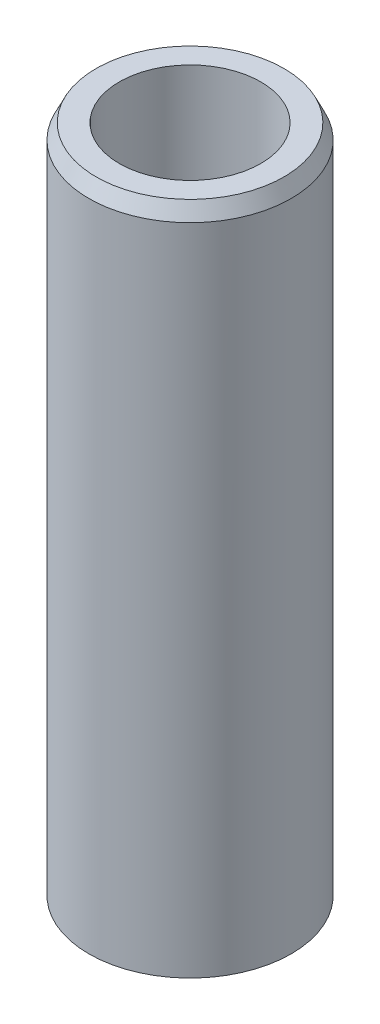
ISO-10303-21;
HEADER;
FILE_DESCRIPTION(('STEP AP214'),'2;1');
FILE_NAME('part.step','',(''),(''),'','','');
FILE_SCHEMA(('AUTOMOTIVE_DESIGN { 1 0 10303 214 1 1 1 1 }'));
ENDSEC;
DATA;
#1=APPLICATION_CONTEXT('core data for automotive mechanical design processes');
#2=APPLICATION_PROTOCOL_DEFINITION('international standard','automotive_design',2000,#1);
#3=PRODUCT_CONTEXT('',#1,'mechanical');
#4=PRODUCT('Part','Part','',(#3));
#5=PRODUCT_RELATED_PRODUCT_CATEGORY('part','',(#4));
#6=PRODUCT_DEFINITION_FORMATION('','',#4);
#7=PRODUCT_DEFINITION_CONTEXT('part definition',#1,'design');
#8=PRODUCT_DEFINITION('design','',#6,#7);
#9=PRODUCT_DEFINITION_SHAPE('','',#8);
#10=(LENGTH_UNIT() NAMED_UNIT(*) SI_UNIT(.MILLI.,.METRE.));
#11=(NAMED_UNIT(*) PLANE_ANGLE_UNIT() SI_UNIT($,.RADIAN.));
#12=(NAMED_UNIT(*) SI_UNIT($,.STERADIAN.) SOLID_ANGLE_UNIT());
#13=UNCERTAINTY_MEASURE_WITH_UNIT(LENGTH_MEASURE(1.E-05),#10,'distance_accuracy_value','');
#14=(GEOMETRIC_REPRESENTATION_CONTEXT(3) GLOBAL_UNCERTAINTY_ASSIGNED_CONTEXT((#13)) GLOBAL_UNIT_ASSIGNED_CONTEXT((#10,
#11,#12)) REPRESENTATION_CONTEXT('',''));
#15=CARTESIAN_POINT('',(0.,0.,0.));
#16=DIRECTION('',(0.,0.,1.));
#17=DIRECTION('',(1.,0.,0.));
#18=AXIS2_PLACEMENT_3D('',#15,#16,#17);
#19=CARTESIAN_POINT('',(0.,167.115657347121,0.));
#20=DIRECTION('',(0.,-1.,0.));
#21=DIRECTION('',(0.,0.,-1.));
#22=AXIS2_PLACEMENT_3D('',#19,#20,#21);
#23=CYLINDRICAL_SURFACE('',#22,25.);
#24=CARTESIAN_POINT('',(0.,163.393621882553,0.));
#25=DIRECTION('',(0.,1.,0.));
#26=DIRECTION('',(0.,0.,1.));
#27=AXIS2_PLACEMENT_3D('',#24,#25,#26);
#28=CIRCLE('',#27,25.);
#29=CARTESIAN_POINT('',(0.,163.393621882553,-25.));
#30=VERTEX_POINT('',#29);
#31=EDGE_CURVE('E50',#30,#30,#28,.F.);
#32=ORIENTED_EDGE('',*,*,#31,.T.);
#33=EDGE_LOOP('',(#32));
#34=FACE_BOUND('',#33,.T.);
#35=CARTESIAN_POINT('',(0.,1.79342687884784,0.));
#36=DIRECTION('',(0.,1.,0.));
#37=DIRECTION('',(0.,0.,1.));
#38=AXIS2_PLACEMENT_3D('',#35,#36,#37);
#39=CIRCLE('',#38,25.);
#40=CARTESIAN_POINT('',(0.,1.79342687884784,25.));
#41=VERTEX_POINT('',#40);
#42=EDGE_CURVE('E51',#41,#41,#39,.T.);
#43=ORIENTED_EDGE('',*,*,#42,.T.);
#44=EDGE_LOOP('',(#43));
#45=FACE_BOUND('',#44,.T.);
#46=ADVANCED_FACE('F39',(#34,#45),#23,.T.);
#47=CARTESIAN_POINT('',(0.,167.115657347121,0.));
#48=DIRECTION('',(0.,1.,0.));
#49=DIRECTION('',(0.,0.,1.));
#50=AXIS2_PLACEMENT_3D('',#47,#48,#49);
#51=PLANE('',#50);
#52=CARTESIAN_POINT('',(0.,167.115657347121,0.));
#53=DIRECTION('',(0.,1.,0.));
#54=DIRECTION('',(0.,0.,1.));
#55=AXIS2_PLACEMENT_3D('',#52,#53,#54);
#56=CIRCLE('',#55,23.2065731211522);
#57=CARTESIAN_POINT('',(0.,167.115657347121,-23.2065731211522));
#58=VERTEX_POINT('',#57);
#59=EDGE_CURVE('E54',#58,#58,#56,.T.);
#60=ORIENTED_EDGE('',*,*,#59,.T.);
#61=EDGE_LOOP('',(#60));
#62=FACE_BOUND('',#61,.T.);
#63=CARTESIAN_POINT('',(0.,167.115657347121,0.));
#64=DIRECTION('',(0.,1.,0.));
#65=DIRECTION('',(0.,0.,1.));
#66=AXIS2_PLACEMENT_3D('',#63,#64,#65);
#67=CIRCLE('',#66,17.4831937573161);
#68=CARTESIAN_POINT('',(0.,167.115657347121,17.4831937573161));
#69=VERTEX_POINT('',#68);
#70=EDGE_CURVE('E58',#69,#69,#67,.T.);
#71=ORIENTED_EDGE('',*,*,#70,.F.);
#72=EDGE_LOOP('',(#71));
#73=FACE_BOUND('',#72,.T.);
#74=ADVANCED_FACE('F69',(#62,#73),#51,.T.);
#75=CARTESIAN_POINT('',(0.,0.,0.));
#76=DIRECTION('',(0.,1.,0.));
#77=DIRECTION('',(0.,0.,1.));
#78=AXIS2_PLACEMENT_3D('',#75,#76,#77);
#79=PLANE('',#78);
#80=CARTESIAN_POINT('',(0.,0.,0.));
#81=DIRECTION('',(0.,1.,0.));
#82=DIRECTION('',(0.,0.,1.));
#83=AXIS2_PLACEMENT_3D('',#80,#81,#82);
#84=CIRCLE('',#83,21.2779645354326);
#85=CARTESIAN_POINT('',(0.,0.,21.2779645354326));
#86=VERTEX_POINT('',#85);
#87=EDGE_CURVE('E10',#86,#86,#84,.F.);
#88=ORIENTED_EDGE('',*,*,#87,.T.);
#89=EDGE_LOOP('',(#88));
#90=FACE_BOUND('',#89,.T.);
#91=CARTESIAN_POINT('',(0.,0.,0.));
#92=DIRECTION('',(0.,1.,0.));
#93=DIRECTION('',(0.,0.,1.));
#94=AXIS2_PLACEMENT_3D('',#91,#92,#93);
#95=CIRCLE('',#94,17.4831937573161);
#96=CARTESIAN_POINT('',(0.,0.,17.4831937573161));
#97=VERTEX_POINT('',#96);
#98=EDGE_CURVE('E63',#97,#97,#95,.T.);
#99=ORIENTED_EDGE('',*,*,#98,.T.);
#100=EDGE_LOOP('',(#99));
#101=FACE_BOUND('',#100,.T.);
#102=ADVANCED_FACE('F75',(#90,#101),#79,.F.);
#103=CARTESIAN_POINT('',(0.,167.115657347121,0.));
#104=DIRECTION('',(0.,-1.,0.));
#105=DIRECTION('',(0.,0.,-1.));
#106=AXIS2_PLACEMENT_3D('',#103,#104,#105);
#107=CYLINDRICAL_SURFACE('',#106,17.4831937573161);
#108=ORIENTED_EDGE('',*,*,#70,.T.);
#109=EDGE_LOOP('',(#108));
#110=FACE_BOUND('',#109,.T.);
#111=ORIENTED_EDGE('',*,*,#98,.F.);
#112=EDGE_LOOP('',(#111));
#113=FACE_BOUND('',#112,.T.);
#114=ADVANCED_FACE('F70',(#110,#113),#107,.F.);
#115=CARTESIAN_POINT('',(0.,167.115657347121,0.));
#116=DIRECTION('',(0.,-1.,0.));
#117=DIRECTION('',(0.,0.,-1.));
#118=AXIS2_PLACEMENT_3D('',#115,#116,#117);
#119=CONICAL_SURFACE('',#118,23.2065731211522,0.449014635765111);
#120=CARTESIAN_POINT('',(0.,163.393621882553,-25.));
#121=CARTESIAN_POINT('',(0.,163.432393085309,-24.981318470012));
#122=CARTESIAN_POINT('',(0.,163.471164288065,-24.962636940024));
#123=CARTESIAN_POINT('',(0.,163.548706693577,-24.925273880048));
#124=CARTESIAN_POINT('',(0.,163.587477896333,-24.90659235006));
#125=CARTESIAN_POINT('',(0.,163.665020301845,-24.869229290084));
#126=CARTESIAN_POINT('',(0.,163.703791504601,-24.850547760096));
#127=CARTESIAN_POINT('',(0.,163.781333910113,-24.81318470012));
#128=CARTESIAN_POINT('',(0.,163.820105112868,-24.794503170132));
#129=CARTESIAN_POINT('',(0.,163.89764751838,-24.757140110156));
#130=CARTESIAN_POINT('',(0.,163.936418721136,-24.738458580168));
#131=CARTESIAN_POINT('',(0.,164.013961126648,-24.701095520192));
#132=CARTESIAN_POINT('',(0.,164.052732329404,-24.682413990204));
#133=CARTESIAN_POINT('',(0.,164.130274734916,-24.645050930228));
#134=CARTESIAN_POINT('',(0.,164.169045937672,-24.62636940024));
#135=CARTESIAN_POINT('',(0.,164.246588343183,-24.589006340264));
#136=CARTESIAN_POINT('',(0.,164.285359545939,-24.5703248102761));
#137=CARTESIAN_POINT('',(0.,164.362901951451,-24.5329617503001));
#138=CARTESIAN_POINT('',(0.,164.401673154207,-24.5142802203121));
#139=CARTESIAN_POINT('',(0.,164.479215559719,-24.4769171603361));
#140=CARTESIAN_POINT('',(0.,164.517986762475,-24.4582356303481));
#141=CARTESIAN_POINT('',(0.,164.595529167987,-24.4208725703721));
#142=CARTESIAN_POINT('',(0.,164.634300370743,-24.4021910403841));
#143=CARTESIAN_POINT('',(0.,164.711842776254,-24.3648279804081));
#144=CARTESIAN_POINT('',(0.,164.75061397901,-24.3461464504201));
#145=CARTESIAN_POINT('',(0.,164.828156384522,-24.3087833904441));
#146=CARTESIAN_POINT('',(0.,164.866927587278,-24.2901018604561));
#147=CARTESIAN_POINT('',(0.,164.94446999279,-24.2527388004801));
#148=CARTESIAN_POINT('',(0.,164.983241195546,-24.2340572704921));
#149=CARTESIAN_POINT('',(0.,165.060783601058,-24.1966942105161));
#150=CARTESIAN_POINT('',(0.,165.099554803814,-24.1780126805281));
#151=CARTESIAN_POINT('',(0.,165.177097209325,-24.1406496205521));
#152=CARTESIAN_POINT('',(0.,165.215868412081,-24.1219680905641));
#153=CARTESIAN_POINT('',(0.,165.293410817593,-24.0846050305881));
#154=CARTESIAN_POINT('',(0.,165.332182020349,-24.0659235006001));
#155=CARTESIAN_POINT('',(0.,165.409724425861,-24.0285604406241));
#156=CARTESIAN_POINT('',(0.,165.448495628617,-24.0098789106361));
#157=CARTESIAN_POINT('',(0.,165.526038034129,-23.9725158506601));
#158=CARTESIAN_POINT('',(0.,165.564809236884,-23.9538343206721));
#159=CARTESIAN_POINT('',(0.,165.642351642396,-23.9164712606961));
#160=CARTESIAN_POINT('',(0.,165.681122845152,-23.8977897307081));
#161=CARTESIAN_POINT('',(0.,165.758665250664,-23.8604266707321));
#162=CARTESIAN_POINT('',(0.,165.79743645342,-23.8417451407441));
#163=CARTESIAN_POINT('',(0.,165.874978858932,-23.8043820807681));
#164=CARTESIAN_POINT('',(0.,165.913750061688,-23.7857005507801));
#165=CARTESIAN_POINT('',(0.,165.991292467199,-23.7483374908041));
#166=CARTESIAN_POINT('',(0.,166.030063669955,-23.7296559608161));
#167=CARTESIAN_POINT('',(0.,166.107606075467,-23.6922929008401));
#168=CARTESIAN_POINT('',(0.,166.146377278223,-23.6736113708521));
#169=CARTESIAN_POINT('',(0.,166.223919683735,-23.6362483108761));
#170=CARTESIAN_POINT('',(0.,166.262690886491,-23.6175667808881));
#171=CARTESIAN_POINT('',(0.,166.340233292003,-23.5802037209121));
#172=CARTESIAN_POINT('',(0.,166.379004494759,-23.5615221909241));
#173=CARTESIAN_POINT('',(0.,166.45654690027,-23.5241591309481));
#174=CARTESIAN_POINT('',(0.,166.495318103026,-23.5054776009601));
#175=CARTESIAN_POINT('',(0.,166.572860508538,-23.4681145409841));
#176=CARTESIAN_POINT('',(0.,166.611631711294,-23.4494330109962));
#177=CARTESIAN_POINT('',(0.,166.689174116806,-23.4120699510202));
#178=CARTESIAN_POINT('',(0.,166.727945319562,-23.3933884210322));
#179=CARTESIAN_POINT('',(0.,166.805487725074,-23.3560253610562));
#180=CARTESIAN_POINT('',(0.,166.84425892783,-23.3373438310682));
#181=CARTESIAN_POINT('',(0.,166.921801333341,-23.2999807710922));
#182=CARTESIAN_POINT('',(0.,166.960572536097,-23.2812992411042));
#183=CARTESIAN_POINT('',(0.,167.038114941609,-23.2439361811282));
#184=CARTESIAN_POINT('',(0.,167.076886144365,-23.2252546511402));
#185=CARTESIAN_POINT('',(0.,167.115657347121,-23.2065731211522));
#186=B_SPLINE_CURVE_WITH_KNOTS('',3,(#120,#121,#122,#123,#124,#125,#126,#127,#128,#129,#130,
#131,#132,#133,#134,#135,#136,#137,#138,#139,#140,#141,#142,#143,#144,#145,#146,#147,#148,#149,
#150,#151,#152,#153,#154,#155,#156,#157,#158,#159,#160,#161,#162,#163,#164,#165,#166,#167,#168,
#169,#170,#171,#172,#173,#174,#175,#176,#177,#178,#179,#180,#181,#182,#183,#184,#185),
.UNSPECIFIED.,.F.,.F.,(4,2,2,2,2,2,2,2,2,2,2,2,2,2,2,2,2,2,2,2,2,2,2,2,2,2,2,2,2,2,2,2,4),(0.,
0.129111779216676,0.258223558433326,0.387335337650001,0.516447116866652,0.645558896083327,
0.774670675299978,0.903782454516629,1.0328942337333,1.16200601294995,1.29111779216663,
1.42022957138328,1.54934135059993,1.67845312981661,1.80756490903326,1.93667668824993,
2.06578846746658,2.19490024668323,2.32401202589991,2.45312380511656,2.58223558433324,
2.71134736354989,2.84045914276654,2.96957092198321,3.09868270119986,3.22779448041654,
3.35690625963319,3.48601803884984,3.61512981806652,3.74424159728317,3.87335337649984,
4.00246515571649,4.13157693493317),.UNSPECIFIED.);
#187=EDGE_CURVE('BSEAM81',#30,#58,#186,.T.);
#188=ORIENTED_EDGE('',*,*,#31,.F.);
#189=ORIENTED_EDGE('',*,*,#59,.F.);
#190=ORIENTED_EDGE('',*,*,#187,.T.);
#191=ORIENTED_EDGE('',*,*,#187,.F.);
#192=EDGE_LOOP('',(#188,#190,#189,#191));
#193=FACE_BOUND('',#192,.T.);
#194=ADVANCED_FACE('F81',(#193),#119,.T.);
#195=CARTESIAN_POINT('',(0.,1.79342687884784,0.));
#196=DIRECTION('',(0.,1.,0.));
#197=DIRECTION('',(0.,0.,1.));
#198=AXIS2_PLACEMENT_3D('',#195,#196,#197);
#199=CONICAL_SURFACE('',#198,25.,1.12178169102978);
#200=ORIENTED_EDGE('',*,*,#87,.F.);
#201=EDGE_LOOP('',(#200));
#202=FACE_BOUND('',#201,.T.);
#203=ORIENTED_EDGE('',*,*,#42,.F.);
#204=EDGE_LOOP('',(#203));
#205=FACE_BOUND('',#204,.T.);
#206=ADVANCED_FACE('F45',(#202,#205),#199,.T.);
#207=CLOSED_SHELL('',(#46,#74,#102,#114,#194,#206));
#208=MANIFOLD_SOLID_BREP('B2',#207);
#209=ADVANCED_BREP_SHAPE_REPRESENTATION('',(#18,#208),#14);
#210=SHAPE_DEFINITION_REPRESENTATION(#9,#209);
ENDSEC;
END-ISO-10303-21;
